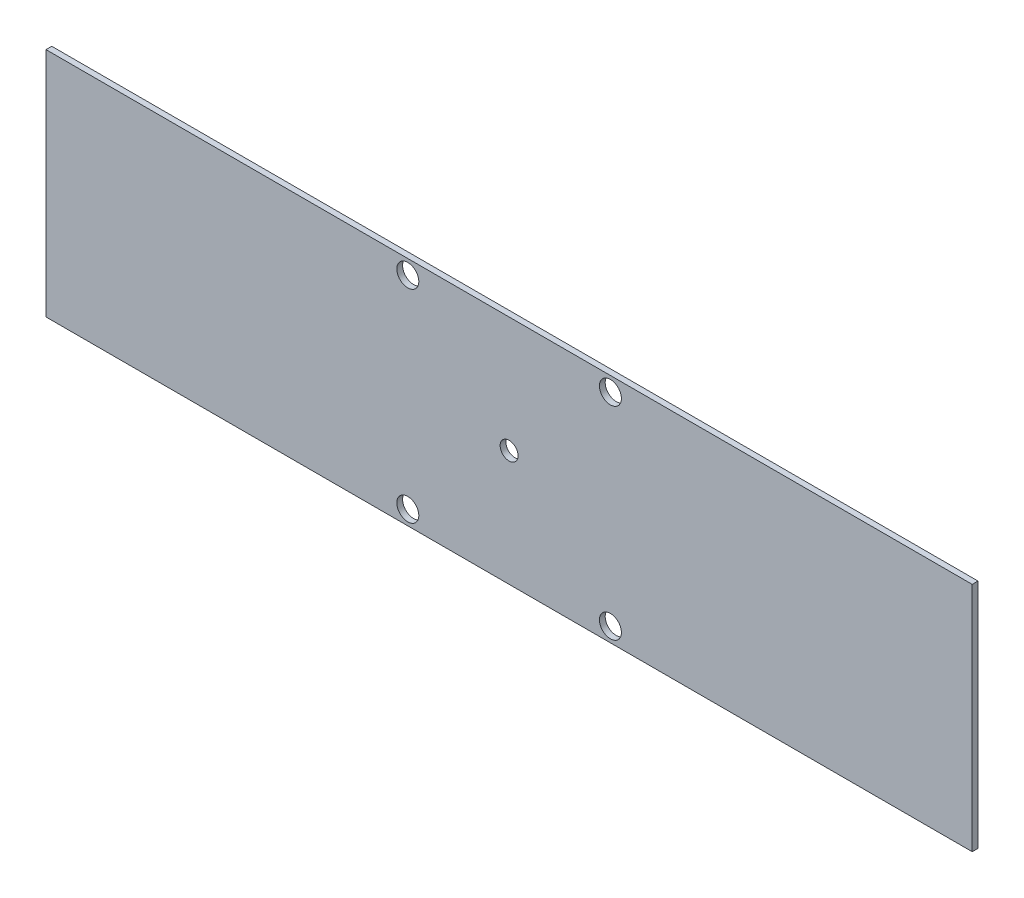
ISO-10303-21;
HEADER;
FILE_DESCRIPTION(('STEP AP214'),'2;1');
FILE_NAME('part.step','',(''),(''),'','','');
FILE_SCHEMA(('AUTOMOTIVE_DESIGN { 1 0 10303 214 1 1 1 1 }'));
ENDSEC;
DATA;
#1=APPLICATION_CONTEXT('core data for automotive mechanical design processes');
#2=APPLICATION_PROTOCOL_DEFINITION('international standard','automotive_design',2000,#1);
#3=PRODUCT_CONTEXT('',#1,'mechanical');
#4=PRODUCT('Part','Part','',(#3));
#5=PRODUCT_RELATED_PRODUCT_CATEGORY('part','',(#4));
#6=PRODUCT_DEFINITION_FORMATION('','',#4);
#7=PRODUCT_DEFINITION_CONTEXT('part definition',#1,'design');
#8=PRODUCT_DEFINITION('design','',#6,#7);
#9=PRODUCT_DEFINITION_SHAPE('','',#8);
#10=(LENGTH_UNIT() NAMED_UNIT(*) SI_UNIT(.MILLI.,.METRE.));
#11=(NAMED_UNIT(*) PLANE_ANGLE_UNIT() SI_UNIT($,.RADIAN.));
#12=(NAMED_UNIT(*) SI_UNIT($,.STERADIAN.) SOLID_ANGLE_UNIT());
#13=UNCERTAINTY_MEASURE_WITH_UNIT(LENGTH_MEASURE(1.E-05),#10,'distance_accuracy_value','');
#14=(GEOMETRIC_REPRESENTATION_CONTEXT(3) GLOBAL_UNCERTAINTY_ASSIGNED_CONTEXT((#13)) GLOBAL_UNIT_ASSIGNED_CONTEXT((#10,
#11,#12)) REPRESENTATION_CONTEXT('',''));
#15=CARTESIAN_POINT('',(0.,0.,0.));
#16=DIRECTION('',(0.,0.,1.));
#17=DIRECTION('',(1.,0.,0.));
#18=AXIS2_PLACEMENT_3D('',#15,#16,#17);
#19=CARTESIAN_POINT('',(0.,0.,-2.54));
#20=DIRECTION('',(0.,0.,-1.));
#21=DIRECTION('',(-1.,0.,0.));
#22=AXIS2_PLACEMENT_3D('',#19,#20,#21);
#23=PLANE('',#22);
#24=DIRECTION('',(0.,-1.,0.));
#25=VECTOR('',#24,1.);
#26=CARTESIAN_POINT('',(-177.8,0.,-2.54));
#27=LINE('',#26,#25);
#28=CARTESIAN_POINT('',(-177.8,38.1,-2.54));
#29=VERTEX_POINT('',#28);
#30=CARTESIAN_POINT('',(-177.8,-38.1,-2.54));
#31=VERTEX_POINT('',#30);
#32=EDGE_CURVE('E193',#29,#31,#27,.T.);
#33=ORIENTED_EDGE('',*,*,#32,.F.);
#34=DIRECTION('',(1.,0.,0.));
#35=VECTOR('',#34,1.);
#36=CARTESIAN_POINT('',(0.,38.1000000000001,-2.54));
#37=LINE('',#36,#35);
#38=CARTESIAN_POINT('',(-190.5,38.1,-2.54));
#39=VERTEX_POINT('',#38);
#40=EDGE_CURVE('E178',#39,#29,#37,.T.);
#41=ORIENTED_EDGE('',*,*,#40,.F.);
#42=DIRECTION('',(0.,1.,0.));
#43=VECTOR('',#42,1.);
#44=CARTESIAN_POINT('',(-190.5,0.,-2.54));
#45=LINE('',#44,#43);
#46=CARTESIAN_POINT('',(-190.5,-38.1,-2.54));
#47=VERTEX_POINT('',#46);
#48=EDGE_CURVE('E189',#47,#39,#45,.T.);
#49=ORIENTED_EDGE('',*,*,#48,.F.);
#50=DIRECTION('',(-1.,0.,0.));
#51=VECTOR('',#50,1.);
#52=CARTESIAN_POINT('',(0.,-38.0999999999999,-2.54));
#53=LINE('',#52,#51);
#54=EDGE_CURVE('E58',#31,#47,#53,.T.);
#55=ORIENTED_EDGE('',*,*,#54,.F.);
#56=EDGE_LOOP('',(#33,#41,#49,#55));
#57=FACE_BOUND('',#56,.T.);
#58=CARTESIAN_POINT('',(0.,0.,-2.54));
#59=DIRECTION('',(0.,0.,1.));
#60=DIRECTION('',(1.,0.,0.));
#61=AXIS2_PLACEMENT_3D('',#58,#59,#60);
#62=CIRCLE('',#61,3.937);
#63=CARTESIAN_POINT('',(3.937,0.,-2.54));
#64=VERTEX_POINT('',#63);
#65=EDGE_CURVE('E196',#64,#64,#62,.T.);
#66=ORIENTED_EDGE('',*,*,#65,.T.);
#67=EDGE_LOOP('',(#66));
#68=FACE_BOUND('',#67,.T.);
#69=CARTESIAN_POINT('',(-44.45,44.45,-2.54));
#70=DIRECTION('',(0.,0.,1.));
#71=DIRECTION('',(1.,0.,0.));
#72=AXIS2_PLACEMENT_3D('',#69,#70,#71);
#73=CIRCLE('',#72,4.826);
#74=CARTESIAN_POINT('',(-39.624,44.45,-2.54));
#75=VERTEX_POINT('',#74);
#76=EDGE_CURVE('E206',#75,#75,#73,.T.);
#77=ORIENTED_EDGE('',*,*,#76,.T.);
#78=EDGE_LOOP('',(#77));
#79=FACE_BOUND('',#78,.T.);
#80=CARTESIAN_POINT('',(44.45,44.45,-2.54));
#81=DIRECTION('',(0.,0.,1.));
#82=DIRECTION('',(1.,0.,0.));
#83=AXIS2_PLACEMENT_3D('',#80,#81,#82);
#84=CIRCLE('',#83,4.826);
#85=CARTESIAN_POINT('',(49.276,44.45,-2.54));
#86=VERTEX_POINT('',#85);
#87=EDGE_CURVE('E212',#86,#86,#84,.T.);
#88=ORIENTED_EDGE('',*,*,#87,.T.);
#89=EDGE_LOOP('',(#88));
#90=FACE_BOUND('',#89,.T.);
#91=CARTESIAN_POINT('',(44.45,-44.45,-2.54));
#92=DIRECTION('',(0.,0.,1.));
#93=DIRECTION('',(1.,0.,0.));
#94=AXIS2_PLACEMENT_3D('',#91,#92,#93);
#95=CIRCLE('',#94,4.826);
#96=CARTESIAN_POINT('',(49.276,-44.45,-2.54));
#97=VERTEX_POINT('',#96);
#98=EDGE_CURVE('E199',#97,#97,#95,.T.);
#99=ORIENTED_EDGE('',*,*,#98,.T.);
#100=EDGE_LOOP('',(#99));
#101=FACE_BOUND('',#100,.T.);
#102=CARTESIAN_POINT('',(-44.45,-44.45,-2.54));
#103=DIRECTION('',(0.,0.,1.));
#104=DIRECTION('',(1.,0.,0.));
#105=AXIS2_PLACEMENT_3D('',#102,#103,#104);
#106=CIRCLE('',#105,4.826);
#107=CARTESIAN_POINT('',(-39.624,-44.45,-2.54));
#108=VERTEX_POINT('',#107);
#109=EDGE_CURVE('E220',#108,#108,#106,.T.);
#110=ORIENTED_EDGE('',*,*,#109,.T.);
#111=EDGE_LOOP('',(#110));
#112=FACE_BOUND('',#111,.T.);
#113=DIRECTION('',(0.,1.,0.));
#114=VECTOR('',#113,1.);
#115=CARTESIAN_POINT('',(203.2,-50.8,-2.54));
#116=LINE('',#115,#114);
#117=CARTESIAN_POINT('',(203.2,-50.8,-2.54));
#118=VERTEX_POINT('',#117);
#119=CARTESIAN_POINT('',(203.2,50.8,-2.54));
#120=VERTEX_POINT('',#119);
#121=EDGE_CURVE('E226',#118,#120,#116,.T.);
#122=ORIENTED_EDGE('',*,*,#121,.F.);
#123=DIRECTION('',(1.,0.,0.));
#124=VECTOR('',#123,1.);
#125=CARTESIAN_POINT('',(-203.2,-50.8,-2.54));
#126=LINE('',#125,#124);
#127=CARTESIAN_POINT('',(-203.2,-50.8,-2.54));
#128=VERTEX_POINT('',#127);
#129=EDGE_CURVE('E236',#128,#118,#126,.T.);
#130=ORIENTED_EDGE('',*,*,#129,.F.);
#131=DIRECTION('',(0.,-1.,0.));
#132=VECTOR('',#131,1.);
#133=CARTESIAN_POINT('',(-203.2,-50.8,-2.54));
#134=LINE('',#133,#132);
#135=CARTESIAN_POINT('',(-203.2,50.8,-2.54));
#136=VERTEX_POINT('',#135);
#137=EDGE_CURVE('E233',#136,#128,#134,.T.);
#138=ORIENTED_EDGE('',*,*,#137,.F.);
#139=DIRECTION('',(-1.,0.,0.));
#140=VECTOR('',#139,1.);
#141=CARTESIAN_POINT('',(-203.2,50.8,-2.54));
#142=LINE('',#141,#140);
#143=EDGE_CURVE('E229',#120,#136,#142,.T.);
#144=ORIENTED_EDGE('',*,*,#143,.F.);
#145=EDGE_LOOP('',(#122,#130,#138,#144));
#146=FACE_BOUND('',#145,.T.);
#147=DIRECTION('',(-1.,0.,0.));
#148=VECTOR('',#147,1.);
#149=CARTESIAN_POINT('',(0.,38.1000000000001,-2.54));
#150=LINE('',#149,#148);
#151=CARTESIAN_POINT('',(190.5,38.1,-2.54));
#152=VERTEX_POINT('',#151);
#153=CARTESIAN_POINT('',(177.8,38.1,-2.54));
#154=VERTEX_POINT('',#153);
#155=EDGE_CURVE('E157',#152,#154,#150,.T.);
#156=ORIENTED_EDGE('',*,*,#155,.T.);
#157=DIRECTION('',(0.,-1.,0.));
#158=VECTOR('',#157,1.);
#159=CARTESIAN_POINT('',(177.8,0.,-2.54));
#160=LINE('',#159,#158);
#161=CARTESIAN_POINT('',(177.8,-38.1,-2.54));
#162=VERTEX_POINT('',#161);
#163=EDGE_CURVE('E160',#154,#162,#160,.T.);
#164=ORIENTED_EDGE('',*,*,#163,.T.);
#165=DIRECTION('',(1.,0.,0.));
#166=VECTOR('',#165,1.);
#167=CARTESIAN_POINT('',(0.,-38.0999999999999,-2.54));
#168=LINE('',#167,#166);
#169=CARTESIAN_POINT('',(190.5,-38.1,-2.54));
#170=VERTEX_POINT('',#169);
#171=EDGE_CURVE('E136',#162,#170,#168,.T.);
#172=ORIENTED_EDGE('',*,*,#171,.T.);
#173=DIRECTION('',(0.,1.,0.));
#174=VECTOR('',#173,1.);
#175=CARTESIAN_POINT('',(190.5,0.,-2.54));
#176=LINE('',#175,#174);
#177=EDGE_CURVE('E154',#170,#152,#176,.T.);
#178=ORIENTED_EDGE('',*,*,#177,.T.);
#179=EDGE_LOOP('',(#156,#164,#172,#178));
#180=FACE_BOUND('',#179,.T.);
#181=ADVANCED_FACE('F33',(#57,#68,#79,#90,#101,#112,#146,#180),#23,.T.);
#182=CARTESIAN_POINT('',(203.2,-50.8,-2.54));
#183=DIRECTION('',(1.,0.,0.));
#184=DIRECTION('',(0.,0.,-1.));
#185=AXIS2_PLACEMENT_3D('',#182,#183,#184);
#186=PLANE('',#185);
#187=DIRECTION('',(0.,1.,0.));
#188=VECTOR('',#187,1.);
#189=CARTESIAN_POINT('',(203.2,-50.8,0.));
#190=LINE('',#189,#188);
#191=CARTESIAN_POINT('',(203.2,-50.8,0.));
#192=VERTEX_POINT('',#191);
#193=CARTESIAN_POINT('',(203.2,50.8,0.));
#194=VERTEX_POINT('',#193);
#195=EDGE_CURVE('E223',#192,#194,#190,.T.);
#196=ORIENTED_EDGE('',*,*,#195,.F.);
#197=DIRECTION('',(0.,0.,1.));
#198=VECTOR('',#197,1.);
#199=CARTESIAN_POINT('',(203.2,-50.8,-2.54));
#200=LINE('',#199,#198);
#201=EDGE_CURVE('E11',#118,#192,#200,.T.);
#202=ORIENTED_EDGE('',*,*,#201,.F.);
#203=ORIENTED_EDGE('',*,*,#121,.T.);
#204=DIRECTION('',(0.,0.,1.));
#205=VECTOR('',#204,1.);
#206=CARTESIAN_POINT('',(203.2,50.8,-2.54));
#207=LINE('',#206,#205);
#208=EDGE_CURVE('E37',#120,#194,#207,.T.);
#209=ORIENTED_EDGE('',*,*,#208,.T.);
#210=EDGE_LOOP('',(#196,#202,#203,#209));
#211=FACE_BOUND('',#210,.T.);
#212=ADVANCED_FACE('F35',(#211),#186,.T.);
#213=CARTESIAN_POINT('',(-203.2,-50.8,-2.54));
#214=DIRECTION('',(0.,-1.,0.));
#215=DIRECTION('',(0.,0.,-1.));
#216=AXIS2_PLACEMENT_3D('',#213,#214,#215);
#217=PLANE('',#216);
#218=DIRECTION('',(1.,0.,0.));
#219=VECTOR('',#218,1.);
#220=CARTESIAN_POINT('',(-203.2,-50.8,0.));
#221=LINE('',#220,#219);
#222=CARTESIAN_POINT('',(-203.2,-50.8,0.));
#223=VERTEX_POINT('',#222);
#224=EDGE_CURVE('E230',#223,#192,#221,.T.);
#225=ORIENTED_EDGE('',*,*,#224,.F.);
#226=DIRECTION('',(0.,0.,1.));
#227=VECTOR('',#226,1.);
#228=CARTESIAN_POINT('',(-203.2,-50.8,-2.54));
#229=LINE('',#228,#227);
#230=EDGE_CURVE('E42',#128,#223,#229,.T.);
#231=ORIENTED_EDGE('',*,*,#230,.F.);
#232=ORIENTED_EDGE('',*,*,#129,.T.);
#233=ORIENTED_EDGE('',*,*,#201,.T.);
#234=EDGE_LOOP('',(#225,#231,#232,#233));
#235=FACE_BOUND('',#234,.T.);
#236=ADVANCED_FACE('F263',(#235),#217,.T.);
#237=CARTESIAN_POINT('',(-203.2,-50.8,-2.54));
#238=DIRECTION('',(-1.,0.,0.));
#239=DIRECTION('',(0.,0.,1.));
#240=AXIS2_PLACEMENT_3D('',#237,#238,#239);
#241=PLANE('',#240);
#242=DIRECTION('',(0.,-1.,0.));
#243=VECTOR('',#242,1.);
#244=CARTESIAN_POINT('',(-203.2,-50.8,0.));
#245=LINE('',#244,#243);
#246=CARTESIAN_POINT('',(-203.2,50.8,0.));
#247=VERTEX_POINT('',#246);
#248=EDGE_CURVE('E244',#247,#223,#245,.T.);
#249=ORIENTED_EDGE('',*,*,#248,.F.);
#250=DIRECTION('',(0.,0.,1.));
#251=VECTOR('',#250,1.);
#252=CARTESIAN_POINT('',(-203.2,50.8,-2.54));
#253=LINE('',#252,#251);
#254=EDGE_CURVE('E249',#136,#247,#253,.T.);
#255=ORIENTED_EDGE('',*,*,#254,.F.);
#256=ORIENTED_EDGE('',*,*,#137,.T.);
#257=ORIENTED_EDGE('',*,*,#230,.T.);
#258=EDGE_LOOP('',(#249,#255,#256,#257));
#259=FACE_BOUND('',#258,.T.);
#260=ADVANCED_FACE('F269',(#259),#241,.T.);
#261=CARTESIAN_POINT('',(-203.2,50.8,-2.54));
#262=DIRECTION('',(0.,1.,0.));
#263=DIRECTION('',(0.,0.,1.));
#264=AXIS2_PLACEMENT_3D('',#261,#262,#263);
#265=PLANE('',#264);
#266=DIRECTION('',(-1.,0.,0.));
#267=VECTOR('',#266,1.);
#268=CARTESIAN_POINT('',(-203.2,50.8,0.));
#269=LINE('',#268,#267);
#270=EDGE_CURVE('E241',#194,#247,#269,.T.);
#271=ORIENTED_EDGE('',*,*,#270,.F.);
#272=ORIENTED_EDGE('',*,*,#208,.F.);
#273=ORIENTED_EDGE('',*,*,#143,.T.);
#274=ORIENTED_EDGE('',*,*,#254,.T.);
#275=EDGE_LOOP('',(#271,#272,#273,#274));
#276=FACE_BOUND('',#275,.T.);
#277=ADVANCED_FACE('F257',(#276),#265,.T.);
#278=CARTESIAN_POINT('',(0.,0.,0.));
#279=DIRECTION('',(0.,0.,-1.));
#280=DIRECTION('',(-1.,0.,0.));
#281=AXIS2_PLACEMENT_3D('',#278,#279,#280);
#282=PLANE('',#281);
#283=ORIENTED_EDGE('',*,*,#195,.T.);
#284=ORIENTED_EDGE('',*,*,#270,.T.);
#285=ORIENTED_EDGE('',*,*,#248,.T.);
#286=ORIENTED_EDGE('',*,*,#224,.T.);
#287=EDGE_LOOP('',(#283,#284,#285,#286));
#288=FACE_BOUND('',#287,.T.);
#289=CARTESIAN_POINT('',(-44.45,-44.45,0.));
#290=DIRECTION('',(0.,0.,1.));
#291=DIRECTION('',(1.,0.,0.));
#292=AXIS2_PLACEMENT_3D('',#289,#290,#291);
#293=CIRCLE('',#292,4.826);
#294=CARTESIAN_POINT('',(-39.624,-44.45,0.));
#295=VERTEX_POINT('',#294);
#296=EDGE_CURVE('E205',#295,#295,#293,.T.);
#297=ORIENTED_EDGE('',*,*,#296,.F.);
#298=EDGE_LOOP('',(#297));
#299=FACE_BOUND('',#298,.T.);
#300=CARTESIAN_POINT('',(44.45,-44.45,0.));
#301=DIRECTION('',(0.,0.,1.));
#302=DIRECTION('',(1.,0.,0.));
#303=AXIS2_PLACEMENT_3D('',#300,#301,#302);
#304=CIRCLE('',#303,4.826);
#305=CARTESIAN_POINT('',(49.276,-44.45,0.));
#306=VERTEX_POINT('',#305);
#307=EDGE_CURVE('E215',#306,#306,#304,.T.);
#308=ORIENTED_EDGE('',*,*,#307,.F.);
#309=EDGE_LOOP('',(#308));
#310=FACE_BOUND('',#309,.T.);
#311=CARTESIAN_POINT('',(44.45,44.45,0.));
#312=DIRECTION('',(0.,0.,1.));
#313=DIRECTION('',(1.,0.,0.));
#314=AXIS2_PLACEMENT_3D('',#311,#312,#313);
#315=CIRCLE('',#314,4.826);
#316=CARTESIAN_POINT('',(49.276,44.45,0.));
#317=VERTEX_POINT('',#316);
#318=EDGE_CURVE('E209',#317,#317,#315,.T.);
#319=ORIENTED_EDGE('',*,*,#318,.F.);
#320=EDGE_LOOP('',(#319));
#321=FACE_BOUND('',#320,.T.);
#322=CARTESIAN_POINT('',(-44.45,44.45,0.));
#323=DIRECTION('',(0.,0.,1.));
#324=DIRECTION('',(1.,0.,0.));
#325=AXIS2_PLACEMENT_3D('',#322,#323,#324);
#326=CIRCLE('',#325,4.826);
#327=CARTESIAN_POINT('',(-39.624,44.45,0.));
#328=VERTEX_POINT('',#327);
#329=EDGE_CURVE('E202',#328,#328,#326,.T.);
#330=ORIENTED_EDGE('',*,*,#329,.F.);
#331=EDGE_LOOP('',(#330));
#332=FACE_BOUND('',#331,.T.);
#333=CARTESIAN_POINT('',(0.,0.,0.));
#334=DIRECTION('',(0.,0.,1.));
#335=DIRECTION('',(1.,0.,0.));
#336=AXIS2_PLACEMENT_3D('',#333,#334,#335);
#337=CIRCLE('',#336,3.937);
#338=CARTESIAN_POINT('',(3.937,0.,0.));
#339=VERTEX_POINT('',#338);
#340=EDGE_CURVE('E195',#339,#339,#337,.T.);
#341=ORIENTED_EDGE('',*,*,#340,.F.);
#342=EDGE_LOOP('',(#341));
#343=FACE_BOUND('',#342,.T.);
#344=ADVANCED_FACE('F259',(#288,#299,#310,#321,#332,#343),#282,.F.);
#345=CARTESIAN_POINT('',(-44.45,-44.45,-2.54));
#346=DIRECTION('',(0.,0.,1.));
#347=DIRECTION('',(1.,0.,0.));
#348=AXIS2_PLACEMENT_3D('',#345,#346,#347);
#349=CYLINDRICAL_SURFACE('',#348,4.826);
#350=ORIENTED_EDGE('',*,*,#109,.F.);
#351=EDGE_LOOP('',(#350));
#352=FACE_BOUND('',#351,.T.);
#353=ORIENTED_EDGE('',*,*,#296,.T.);
#354=EDGE_LOOP('',(#353));
#355=FACE_BOUND('',#354,.T.);
#356=ADVANCED_FACE('F285',(#352,#355),#349,.F.);
#357=CARTESIAN_POINT('',(44.45,-44.45,-2.54));
#358=DIRECTION('',(0.,0.,1.));
#359=DIRECTION('',(1.,0.,0.));
#360=AXIS2_PLACEMENT_3D('',#357,#358,#359);
#361=CYLINDRICAL_SURFACE('',#360,4.826);
#362=ORIENTED_EDGE('',*,*,#98,.F.);
#363=EDGE_LOOP('',(#362));
#364=FACE_BOUND('',#363,.T.);
#365=ORIENTED_EDGE('',*,*,#307,.T.);
#366=EDGE_LOOP('',(#365));
#367=FACE_BOUND('',#366,.T.);
#368=ADVANCED_FACE('F291',(#364,#367),#361,.F.);
#369=CARTESIAN_POINT('',(44.45,44.45,-2.54));
#370=DIRECTION('',(0.,0.,1.));
#371=DIRECTION('',(1.,0.,0.));
#372=AXIS2_PLACEMENT_3D('',#369,#370,#371);
#373=CYLINDRICAL_SURFACE('',#372,4.826);
#374=ORIENTED_EDGE('',*,*,#87,.F.);
#375=EDGE_LOOP('',(#374));
#376=FACE_BOUND('',#375,.T.);
#377=ORIENTED_EDGE('',*,*,#318,.T.);
#378=EDGE_LOOP('',(#377));
#379=FACE_BOUND('',#378,.T.);
#380=ADVANCED_FACE('F296',(#376,#379),#373,.F.);
#381=CARTESIAN_POINT('',(-44.45,44.45,-2.54));
#382=DIRECTION('',(0.,0.,1.));
#383=DIRECTION('',(1.,0.,0.));
#384=AXIS2_PLACEMENT_3D('',#381,#382,#383);
#385=CYLINDRICAL_SURFACE('',#384,4.826);
#386=ORIENTED_EDGE('',*,*,#76,.F.);
#387=EDGE_LOOP('',(#386));
#388=FACE_BOUND('',#387,.T.);
#389=ORIENTED_EDGE('',*,*,#329,.T.);
#390=EDGE_LOOP('',(#389));
#391=FACE_BOUND('',#390,.T.);
#392=ADVANCED_FACE('F313',(#388,#391),#385,.F.);
#393=CARTESIAN_POINT('',(0.,0.,-2.54));
#394=DIRECTION('',(0.,0.,1.));
#395=DIRECTION('',(1.,0.,0.));
#396=AXIS2_PLACEMENT_3D('',#393,#394,#395);
#397=CYLINDRICAL_SURFACE('',#396,3.937);
#398=ORIENTED_EDGE('',*,*,#65,.F.);
#399=EDGE_LOOP('',(#398));
#400=FACE_BOUND('',#399,.T.);
#401=ORIENTED_EDGE('',*,*,#340,.T.);
#402=EDGE_LOOP('',(#401));
#403=FACE_BOUND('',#402,.T.);
#404=ADVANCED_FACE('F310',(#400,#403),#397,.F.);
#405=CARTESIAN_POINT('',(-177.8,38.1,-12.7));
#406=DIRECTION('',(1.,0.,0.));
#407=DIRECTION('',(0.,0.,-1.));
#408=AXIS2_PLACEMENT_3D('',#405,#406,#407);
#409=PLANE('',#408);
#410=DIRECTION('',(0.,0.,1.));
#411=VECTOR('',#410,1.);
#412=CARTESIAN_POINT('',(-177.8,38.1,-12.7));
#413=LINE('',#412,#411);
#414=CARTESIAN_POINT('',(-177.8,38.1,-12.7));
#415=VERTEX_POINT('',#414);
#416=EDGE_CURVE('E174',#415,#29,#413,.T.);
#417=ORIENTED_EDGE('',*,*,#416,.T.);
#418=ORIENTED_EDGE('',*,*,#32,.T.);
#419=DIRECTION('',(0.,0.,1.));
#420=VECTOR('',#419,1.);
#421=CARTESIAN_POINT('',(-177.8,-38.1,-12.7));
#422=LINE('',#421,#420);
#423=CARTESIAN_POINT('',(-177.8,-38.1,-12.7));
#424=VERTEX_POINT('',#423);
#425=EDGE_CURVE('E175',#424,#31,#422,.T.);
#426=ORIENTED_EDGE('',*,*,#425,.F.);
#427=DIRECTION('',(0.,1.,0.));
#428=VECTOR('',#427,1.);
#429=CARTESIAN_POINT('',(-177.8,38.1,-12.7));
#430=LINE('',#429,#428);
#431=EDGE_CURVE('E162',#424,#415,#430,.T.);
#432=ORIENTED_EDGE('',*,*,#431,.T.);
#433=EDGE_LOOP('',(#417,#418,#426,#432));
#434=FACE_BOUND('',#433,.T.);
#435=ADVANCED_FACE('F312',(#434),#409,.T.);
#436=CARTESIAN_POINT('',(-177.8,-38.1,-12.7));
#437=DIRECTION('',(0.,-1.,0.));
#438=DIRECTION('',(1.,0.,0.));
#439=AXIS2_PLACEMENT_3D('',#436,#437,#438);
#440=PLANE('',#439);
#441=ORIENTED_EDGE('',*,*,#425,.T.);
#442=ORIENTED_EDGE('',*,*,#54,.T.);
#443=DIRECTION('',(0.,0.,1.));
#444=VECTOR('',#443,1.);
#445=CARTESIAN_POINT('',(-190.5,-38.1,-12.7));
#446=LINE('',#445,#444);
#447=CARTESIAN_POINT('',(-190.5,-38.1,-12.7));
#448=VERTEX_POINT('',#447);
#449=EDGE_CURVE('E179',#448,#47,#446,.T.);
#450=ORIENTED_EDGE('',*,*,#449,.F.);
#451=DIRECTION('',(1.,0.,0.));
#452=VECTOR('',#451,1.);
#453=CARTESIAN_POINT('',(-177.8,-38.1,-12.7));
#454=LINE('',#453,#452);
#455=EDGE_CURVE('E171',#448,#424,#454,.T.);
#456=ORIENTED_EDGE('',*,*,#455,.T.);
#457=EDGE_LOOP('',(#441,#442,#450,#456));
#458=FACE_BOUND('',#457,.T.);
#459=ADVANCED_FACE('F320',(#458),#440,.T.);
#460=CARTESIAN_POINT('',(-190.5,38.1,-12.7));
#461=DIRECTION('',(-1.,0.,0.));
#462=DIRECTION('',(0.,0.,1.));
#463=AXIS2_PLACEMENT_3D('',#460,#461,#462);
#464=PLANE('',#463);
#465=ORIENTED_EDGE('',*,*,#449,.T.);
#466=ORIENTED_EDGE('',*,*,#48,.T.);
#467=DIRECTION('',(0.,0.,1.));
#468=VECTOR('',#467,1.);
#469=CARTESIAN_POINT('',(-190.5,38.1,-12.7));
#470=LINE('',#469,#468);
#471=CARTESIAN_POINT('',(-190.5,38.1,-12.7));
#472=VERTEX_POINT('',#471);
#473=EDGE_CURVE('E182',#472,#39,#470,.T.);
#474=ORIENTED_EDGE('',*,*,#473,.F.);
#475=DIRECTION('',(0.,-1.,0.));
#476=VECTOR('',#475,1.);
#477=CARTESIAN_POINT('',(-190.5,38.1,-12.7));
#478=LINE('',#477,#476);
#479=EDGE_CURVE('E168',#472,#448,#478,.T.);
#480=ORIENTED_EDGE('',*,*,#479,.T.);
#481=EDGE_LOOP('',(#465,#466,#474,#480));
#482=FACE_BOUND('',#481,.T.);
#483=ADVANCED_FACE('F364',(#482),#464,.T.);
#484=CARTESIAN_POINT('',(-177.8,38.1,-12.7));
#485=DIRECTION('',(0.,1.,0.));
#486=DIRECTION('',(-1.,0.,0.));
#487=AXIS2_PLACEMENT_3D('',#484,#485,#486);
#488=PLANE('',#487);
#489=ORIENTED_EDGE('',*,*,#473,.T.);
#490=ORIENTED_EDGE('',*,*,#40,.T.);
#491=ORIENTED_EDGE('',*,*,#416,.F.);
#492=DIRECTION('',(-1.,0.,0.));
#493=VECTOR('',#492,1.);
#494=CARTESIAN_POINT('',(-177.8,38.1,-12.7));
#495=LINE('',#494,#493);
#496=EDGE_CURVE('E165',#415,#472,#495,.T.);
#497=ORIENTED_EDGE('',*,*,#496,.T.);
#498=EDGE_LOOP('',(#489,#490,#491,#497));
#499=FACE_BOUND('',#498,.T.);
#500=ADVANCED_FACE('F374',(#499),#488,.T.);
#501=CARTESIAN_POINT('',(0.,0.,-12.7));
#502=DIRECTION('',(0.,0.,-1.));
#503=DIRECTION('',(-1.,0.,0.));
#504=AXIS2_PLACEMENT_3D('',#501,#502,#503);
#505=PLANE('',#504);
#506=ORIENTED_EDGE('',*,*,#431,.F.);
#507=ORIENTED_EDGE('',*,*,#455,.F.);
#508=ORIENTED_EDGE('',*,*,#479,.F.);
#509=ORIENTED_EDGE('',*,*,#496,.F.);
#510=EDGE_LOOP('',(#506,#507,#508,#509));
#511=FACE_BOUND('',#510,.T.);
#512=ADVANCED_FACE('F384',(#511),#505,.T.);
#513=CARTESIAN_POINT('',(177.8,38.1,-12.7));
#514=DIRECTION('',(1.,0.,0.));
#515=DIRECTION('',(0.,0.,-1.));
#516=AXIS2_PLACEMENT_3D('',#513,#514,#515);
#517=PLANE('',#516);
#518=ORIENTED_EDGE('',*,*,#163,.F.);
#519=DIRECTION('',(0.,0.,1.));
#520=VECTOR('',#519,1.);
#521=CARTESIAN_POINT('',(177.8,38.1,-12.7));
#522=LINE('',#521,#520);
#523=CARTESIAN_POINT('',(177.8,38.1,-12.7));
#524=VERTEX_POINT('',#523);
#525=EDGE_CURVE('E143',#524,#154,#522,.T.);
#526=ORIENTED_EDGE('',*,*,#525,.F.);
#527=DIRECTION('',(0.,1.,0.));
#528=VECTOR('',#527,1.);
#529=CARTESIAN_POINT('',(177.8,38.1,-12.7));
#530=LINE('',#529,#528);
#531=CARTESIAN_POINT('',(177.8,-38.1,-12.7));
#532=VERTEX_POINT('',#531);
#533=EDGE_CURVE('E127',#532,#524,#530,.T.);
#534=ORIENTED_EDGE('',*,*,#533,.F.);
#535=DIRECTION('',(0.,0.,1.));
#536=VECTOR('',#535,1.);
#537=CARTESIAN_POINT('',(177.8,-38.1,-12.7));
#538=LINE('',#537,#536);
#539=EDGE_CURVE('E133',#532,#162,#538,.T.);
#540=ORIENTED_EDGE('',*,*,#539,.T.);
#541=EDGE_LOOP('',(#518,#526,#534,#540));
#542=FACE_BOUND('',#541,.T.);
#543=ADVANCED_FACE('F141',(#542),#517,.F.);
#544=CARTESIAN_POINT('',(177.8,38.1,-12.7));
#545=DIRECTION('',(0.,-1.,0.));
#546=DIRECTION('',(1.,0.,0.));
#547=AXIS2_PLACEMENT_3D('',#544,#545,#546);
#548=PLANE('',#547);
#549=ORIENTED_EDGE('',*,*,#155,.F.);
#550=DIRECTION('',(0.,0.,1.));
#551=VECTOR('',#550,1.);
#552=CARTESIAN_POINT('',(190.5,38.1,-12.7));
#553=LINE('',#552,#551);
#554=CARTESIAN_POINT('',(190.5,38.1,-12.7));
#555=VERTEX_POINT('',#554);
#556=EDGE_CURVE('E149',#555,#152,#553,.T.);
#557=ORIENTED_EDGE('',*,*,#556,.F.);
#558=DIRECTION('',(1.,0.,0.));
#559=VECTOR('',#558,1.);
#560=CARTESIAN_POINT('',(177.8,38.1,-12.7));
#561=LINE('',#560,#559);
#562=EDGE_CURVE('E139',#524,#555,#561,.T.);
#563=ORIENTED_EDGE('',*,*,#562,.F.);
#564=ORIENTED_EDGE('',*,*,#525,.T.);
#565=EDGE_LOOP('',(#549,#557,#563,#564));
#566=FACE_BOUND('',#565,.T.);
#567=ADVANCED_FACE('F412',(#566),#548,.F.);
#568=CARTESIAN_POINT('',(190.5,38.1,-12.7));
#569=DIRECTION('',(-1.,0.,0.));
#570=DIRECTION('',(0.,0.,1.));
#571=AXIS2_PLACEMENT_3D('',#568,#569,#570);
#572=PLANE('',#571);
#573=ORIENTED_EDGE('',*,*,#177,.F.);
#574=DIRECTION('',(0.,0.,1.));
#575=VECTOR('',#574,1.);
#576=CARTESIAN_POINT('',(190.5,-38.1,-12.7));
#577=LINE('',#576,#575);
#578=CARTESIAN_POINT('',(190.5,-38.1,-12.7));
#579=VERTEX_POINT('',#578);
#580=EDGE_CURVE('E50',#579,#170,#577,.T.);
#581=ORIENTED_EDGE('',*,*,#580,.F.);
#582=DIRECTION('',(0.,-1.,0.));
#583=VECTOR('',#582,1.);
#584=CARTESIAN_POINT('',(190.5,38.1,-12.7));
#585=LINE('',#584,#583);
#586=EDGE_CURVE('E130',#555,#579,#585,.T.);
#587=ORIENTED_EDGE('',*,*,#586,.F.);
#588=ORIENTED_EDGE('',*,*,#556,.T.);
#589=EDGE_LOOP('',(#573,#581,#587,#588));
#590=FACE_BOUND('',#589,.T.);
#591=ADVANCED_FACE('F421',(#590),#572,.F.);
#592=CARTESIAN_POINT('',(177.8,-38.1,-12.7));
#593=DIRECTION('',(0.,1.,0.));
#594=DIRECTION('',(-1.,0.,0.));
#595=AXIS2_PLACEMENT_3D('',#592,#593,#594);
#596=PLANE('',#595);
#597=ORIENTED_EDGE('',*,*,#171,.F.);
#598=ORIENTED_EDGE('',*,*,#539,.F.);
#599=DIRECTION('',(-1.,0.,0.));
#600=VECTOR('',#599,1.);
#601=CARTESIAN_POINT('',(177.8,-38.1,-12.7));
#602=LINE('',#601,#600);
#603=EDGE_CURVE('E123',#579,#532,#602,.T.);
#604=ORIENTED_EDGE('',*,*,#603,.F.);
#605=ORIENTED_EDGE('',*,*,#580,.T.);
#606=EDGE_LOOP('',(#597,#598,#604,#605));
#607=FACE_BOUND('',#606,.T.);
#608=ADVANCED_FACE('F134',(#607),#596,.F.);
#609=CARTESIAN_POINT('',(0.,0.,-12.7));
#610=DIRECTION('',(0.,0.,-1.));
#611=DIRECTION('',(1.,0.,0.));
#612=AXIS2_PLACEMENT_3D('',#609,#610,#611);
#613=PLANE('',#612);
#614=ORIENTED_EDGE('',*,*,#533,.T.);
#615=ORIENTED_EDGE('',*,*,#562,.T.);
#616=ORIENTED_EDGE('',*,*,#586,.T.);
#617=ORIENTED_EDGE('',*,*,#603,.T.);
#618=EDGE_LOOP('',(#614,#615,#616,#617));
#619=FACE_BOUND('',#618,.T.);
#620=ADVANCED_FACE('F125',(#619),#613,.T.);
#621=CLOSED_SHELL('',(#181,#212,#236,#260,#277,#344,#356,#368,#380,#392,#404,#435,#459,#483,
#500,#512,#543,#567,#591,#608,#620));
#622=MANIFOLD_SOLID_BREP('B2',#621);
#623=ADVANCED_BREP_SHAPE_REPRESENTATION('',(#18,#622),#14);
#624=SHAPE_DEFINITION_REPRESENTATION(#9,#623);
ENDSEC;
END-ISO-10303-21;
